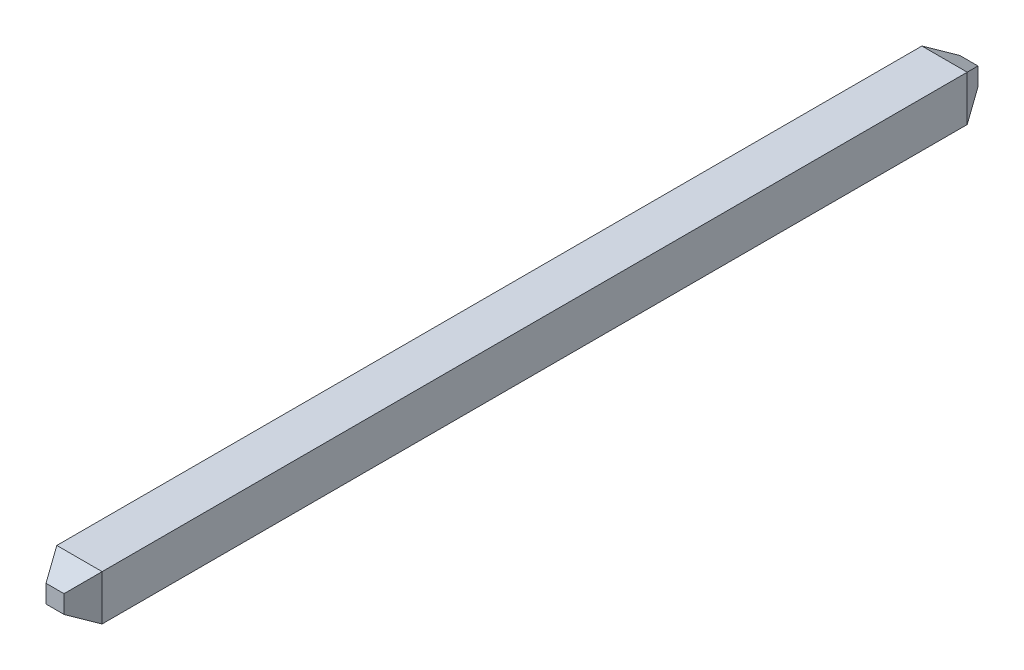
ISO-10303-21;
HEADER;
FILE_DESCRIPTION(('STEP AP214'),'2;1');
FILE_NAME('part.step','',(''),(''),'','','');
FILE_SCHEMA(('AUTOMOTIVE_DESIGN { 1 0 10303 214 1 1 1 1 }'));
ENDSEC;
DATA;
#1=APPLICATION_CONTEXT('core data for automotive mechanical design processes');
#2=APPLICATION_PROTOCOL_DEFINITION('international standard','automotive_design',2000,#1);
#3=PRODUCT_CONTEXT('',#1,'mechanical');
#4=PRODUCT('Part','Part','',(#3));
#5=PRODUCT_RELATED_PRODUCT_CATEGORY('part','',(#4));
#6=PRODUCT_DEFINITION_FORMATION('','',#4);
#7=PRODUCT_DEFINITION_CONTEXT('part definition',#1,'design');
#8=PRODUCT_DEFINITION('design','',#6,#7);
#9=PRODUCT_DEFINITION_SHAPE('','',#8);
#10=(LENGTH_UNIT() NAMED_UNIT(*) SI_UNIT(.MILLI.,.METRE.));
#11=(NAMED_UNIT(*) PLANE_ANGLE_UNIT() SI_UNIT($,.RADIAN.));
#12=(NAMED_UNIT(*) SI_UNIT($,.STERADIAN.) SOLID_ANGLE_UNIT());
#13=UNCERTAINTY_MEASURE_WITH_UNIT(LENGTH_MEASURE(1.E-05),#10,'distance_accuracy_value','');
#14=(GEOMETRIC_REPRESENTATION_CONTEXT(3) GLOBAL_UNCERTAINTY_ASSIGNED_CONTEXT((#13)) GLOBAL_UNIT_ASSIGNED_CONTEXT((#10,
#11,#12)) REPRESENTATION_CONTEXT('',''));
#15=CARTESIAN_POINT('',(0.,0.,0.));
#16=DIRECTION('',(0.,0.,1.));
#17=DIRECTION('',(1.,0.,0.));
#18=AXIS2_PLACEMENT_3D('',#15,#16,#17);
#19=CARTESIAN_POINT('',(10.2801151004192,-1.595,-3.20872569516347));
#20=DIRECTION('',(0.872569516347454,0.,-0.48848995807608));
#21=DIRECTION('',(-0.48848995807608,0.,-0.872569516347454));
#22=AXIS2_PLACEMENT_3D('',#19,#20,#21);
#23=PLANE('',#22);
#24=DIRECTION('',(0.,1.,0.));
#25=VECTOR('',#24,1.);
#26=CARTESIAN_POINT('',(10.4753418566447,-1.595,-2.86000017186176));
#27=LINE('',#26,#25);
#28=CARTESIAN_POINT('',(10.4753418566326,-1.58500002468493,-2.85999984563026));
#29=VERTEX_POINT('',#28);
#30=CARTESIAN_POINT('',(10.4753420172919,-0.954999839641339,-2.85999988490429));
#31=VERTEX_POINT('',#30);
#32=EDGE_CURVE('E145',#29,#31,#27,.T.);
#33=ORIENTED_EDGE('',*,*,#32,.F.);
#34=DIRECTION('',(0.439072617568685,-0.438284036988102,0.784297353956263));
#35=VECTOR('',#34,1.);
#36=CARTESIAN_POINT('',(10.285,-1.395,-3.2));
#37=LINE('',#36,#35);
#38=CARTESIAN_POINT('',(10.285,-1.395,-3.2));
#39=VERTEX_POINT('',#38);
#40=EDGE_CURVE('E142',#39,#29,#37,.T.);
#41=ORIENTED_EDGE('',*,*,#40,.F.);
#42=DIRECTION('',(0.,1.,0.));
#43=VECTOR('',#42,1.);
#44=CARTESIAN_POINT('',(10.285,-1.405,-3.2));
#45=LINE('',#44,#43);
#46=CARTESIAN_POINT('',(10.285,-1.145,-3.2));
#47=VERTEX_POINT('',#46);
#48=EDGE_CURVE('E95',#47,#39,#45,.F.);
#49=ORIENTED_EDGE('',*,*,#48,.F.);
#50=DIRECTION('',(-0.439072617568685,-0.438284036988102,-0.784297353956263));
#51=VECTOR('',#50,1.);
#52=CARTESIAN_POINT('',(10.4753418566447,-0.955000000000001,-2.86000017186176));
#53=LINE('',#52,#51);
#54=EDGE_CURVE('E134',#31,#47,#53,.T.);
#55=ORIENTED_EDGE('',*,*,#54,.F.);
#56=EDGE_LOOP('',(#33,#41,#49,#55));
#57=FACE_BOUND('',#56,.T.);
#58=ADVANCED_FACE('F16',(#57),#23,.T.);
#59=CARTESIAN_POINT('',(10.2803670281429,-1.595,9.50441734607014));
#60=DIRECTION('',(0.873317045523296,0.,0.487152273933378));
#61=DIRECTION('',(0.487152273933378,0.,-0.873317045523296));
#62=AXIS2_PLACEMENT_3D('',#59,#60,#61);
#63=PLANE('',#62);
#64=DIRECTION('',(-0.437799852400756,0.438586917260879,0.784839349959898));
#65=VECTOR('',#64,1.);
#66=CARTESIAN_POINT('',(10.4748978995516,-1.58500031317149,9.15568378706481));
#67=LINE('',#66,#65);
#68=CARTESIAN_POINT('',(10.4748976545499,-1.58500010892316,9.155683688451));
#69=VERTEX_POINT('',#68);
#70=CARTESIAN_POINT('',(10.2852385508823,-1.395,9.4956841756149));
#71=VERTEX_POINT('',#70);
#72=EDGE_CURVE('E151',#69,#71,#67,.T.);
#73=ORIENTED_EDGE('',*,*,#72,.F.);
#74=DIRECTION('',(0.,1.,0.));
#75=VECTOR('',#74,1.);
#76=CARTESIAN_POINT('',(10.4748985390065,-1.595,9.15568372243695));
#77=LINE('',#76,#75);
#78=CARTESIAN_POINT('',(10.4748976528046,-0.954999822967403,9.15568371270384));
#79=VERTEX_POINT('',#78);
#80=EDGE_CURVE('E106',#79,#69,#77,.F.);
#81=ORIENTED_EDGE('',*,*,#80,.F.);
#82=DIRECTION('',(0.437799852400942,0.438586917260834,-0.784839349959819));
#83=VECTOR('',#82,1.);
#84=CARTESIAN_POINT('',(10.2852385508823,-1.145,9.49568417561491));
#85=LINE('',#84,#83);
#86=CARTESIAN_POINT('',(10.2852385508823,-1.145,9.4956841756149));
#87=VERTEX_POINT('',#86);
#88=EDGE_CURVE('E101',#87,#79,#85,.T.);
#89=ORIENTED_EDGE('',*,*,#88,.F.);
#90=DIRECTION('',(0.,1.,0.));
#91=VECTOR('',#90,1.);
#92=CARTESIAN_POINT('',(10.2852385508823,-1.135,9.49568417561491));
#93=LINE('',#92,#91);
#94=EDGE_CURVE('E19',#71,#87,#93,.T.);
#95=ORIENTED_EDGE('',*,*,#94,.F.);
#96=EDGE_LOOP('',(#73,#81,#89,#95));
#97=FACE_BOUND('',#96,.T.);
#98=ADVANCED_FACE('F103',(#97),#63,.T.);
#99=CARTESIAN_POINT('',(10.0252385508823,-1.135,9.49568417561491));
#100=DIRECTION('',(0.,0.,1.));
#101=DIRECTION('',(1.,0.,0.));
#102=AXIS2_PLACEMENT_3D('',#99,#100,#101);
#103=PLANE('',#102);
#104=DIRECTION('',(1.,0.,0.));
#105=VECTOR('',#104,1.);
#106=CARTESIAN_POINT('',(9.8348966942376,-1.145,9.49568417561491));
#107=LINE('',#106,#105);
#108=CARTESIAN_POINT('',(10.0352385508823,-1.145,9.49568417561492));
#109=VERTEX_POINT('',#108);
#110=EDGE_CURVE('E111',#109,#87,#107,.T.);
#111=ORIENTED_EDGE('',*,*,#110,.F.);
#112=DIRECTION('',(0.,1.,0.));
#113=VECTOR('',#112,1.);
#114=CARTESIAN_POINT('',(10.0352385508823,-1.595,9.49568417561494));
#115=LINE('',#114,#113);
#116=CARTESIAN_POINT('',(10.0352385508823,-1.395,9.49568417561492));
#117=VERTEX_POINT('',#116);
#118=EDGE_CURVE('E161',#117,#109,#115,.T.);
#119=ORIENTED_EDGE('',*,*,#118,.F.);
#120=DIRECTION('',(1.,0.,0.));
#121=VECTOR('',#120,1.);
#122=CARTESIAN_POINT('',(9.8348966942376,-1.395,9.49568417561491));
#123=LINE('',#122,#121);
#124=EDGE_CURVE('E116',#71,#117,#123,.F.);
#125=ORIENTED_EDGE('',*,*,#124,.F.);
#126=ORIENTED_EDGE('',*,*,#94,.T.);
#127=EDGE_LOOP('',(#111,#119,#125,#126));
#128=FACE_BOUND('',#127,.T.);
#129=ADVANCED_FACE('F113',(#128),#103,.T.);
#130=CARTESIAN_POINT('',(9.8348966942376,-1.14987821545568,9.50441360938624));
#131=DIRECTION('',(0.,0.872943377132664,0.487821545567864));
#132=DIRECTION('',(0.,-0.487821545567864,0.872943377132664));
#133=AXIS2_PLACEMENT_3D('',#130,#131,#132);
#134=PLANE('',#133);
#135=DIRECTION('',(-0.439072459537936,0.438284700441645,-0.784297071672516));
#136=VECTOR('',#135,1.);
#137=CARTESIAN_POINT('',(10.0352385508823,-1.145,9.49568417561494));
#138=LINE('',#137,#136);
#139=CARTESIAN_POINT('',(9.84489750370277,-0.954999917527418,9.15568447138296));
#140=VERTEX_POINT('',#139);
#141=EDGE_CURVE('E121',#109,#140,#138,.T.);
#142=ORIENTED_EDGE('',*,*,#141,.F.);
#143=ORIENTED_EDGE('',*,*,#110,.T.);
#144=ORIENTED_EDGE('',*,*,#88,.T.);
#145=DIRECTION('',(1.,0.,0.));
#146=VECTOR('',#145,1.);
#147=CARTESIAN_POINT('',(10.1600665893728,-0.955,9.15568497320465));
#148=LINE('',#147,#146);
#149=EDGE_CURVE('E164',#140,#79,#148,.T.);
#150=ORIENTED_EDGE('',*,*,#149,.F.);
#151=EDGE_LOOP('',(#142,#143,#144,#150));
#152=FACE_BOUND('',#151,.T.);
#153=ADVANCED_FACE('F119',(#152),#134,.T.);
#154=CARTESIAN_POINT('',(10.025,-1.405,-3.2));
#155=DIRECTION('',(0.,0.,-1.));
#156=DIRECTION('',(-1.,0.,0.));
#157=AXIS2_PLACEMENT_3D('',#154,#155,#156);
#158=PLANE('',#157);
#159=ORIENTED_EDGE('',*,*,#48,.T.);
#160=DIRECTION('',(1.,0.,0.));
#161=VECTOR('',#160,1.);
#162=CARTESIAN_POINT('',(9.83534185664468,-1.395,-3.2));
#163=LINE('',#162,#161);
#164=CARTESIAN_POINT('',(10.035,-1.395,-3.2));
#165=VERTEX_POINT('',#164);
#166=EDGE_CURVE('E138',#165,#39,#163,.T.);
#167=ORIENTED_EDGE('',*,*,#166,.F.);
#168=DIRECTION('',(0.,1.,0.));
#169=VECTOR('',#168,1.);
#170=CARTESIAN_POINT('',(10.035,-1.595,-3.20000000000001));
#171=LINE('',#170,#169);
#172=CARTESIAN_POINT('',(10.035,-1.145,-3.2));
#173=VERTEX_POINT('',#172);
#174=EDGE_CURVE('E176',#173,#165,#171,.F.);
#175=ORIENTED_EDGE('',*,*,#174,.F.);
#176=DIRECTION('',(1.,0.,0.));
#177=VECTOR('',#176,1.);
#178=CARTESIAN_POINT('',(9.83534185664468,-1.145,-3.2));
#179=LINE('',#178,#177);
#180=EDGE_CURVE('E128',#47,#173,#179,.F.);
#181=ORIENTED_EDGE('',*,*,#180,.F.);
#182=EDGE_LOOP('',(#159,#167,#175,#181));
#183=FACE_BOUND('',#182,.T.);
#184=ADVANCED_FACE('F229',(#183),#158,.T.);
#185=CARTESIAN_POINT('',(9.83534185664468,-0.950121784544321,-2.85127073809043));
#186=DIRECTION('',(0.,0.872943377132663,-0.487821545567865));
#187=DIRECTION('',(0.,0.487821545567865,0.872943377132663));
#188=AXIS2_PLACEMENT_3D('',#185,#186,#187);
#189=PLANE('',#188);
#190=DIRECTION('',(1.,0.,0.));
#191=VECTOR('',#190,1.);
#192=CARTESIAN_POINT('',(10.1600665893728,-0.955,-2.86000017186176));
#193=LINE('',#192,#191);
#194=CARTESIAN_POINT('',(9.84534144768618,-0.954999293190896,-2.8599984305592));
#195=VERTEX_POINT('',#194);
#196=EDGE_CURVE('E172',#31,#195,#193,.F.);
#197=ORIENTED_EDGE('',*,*,#196,.F.);
#198=ORIENTED_EDGE('',*,*,#54,.T.);
#199=ORIENTED_EDGE('',*,*,#180,.T.);
#200=DIRECTION('',(0.437798396819591,-0.438586429089659,-0.784840434713055));
#201=VECTOR('',#200,1.);
#202=CARTESIAN_POINT('',(9.84534066407529,-0.954999279369218,-2.85999803394472));
#203=LINE('',#202,#201);
#204=EDGE_CURVE('E183',#195,#173,#203,.T.);
#205=ORIENTED_EDGE('',*,*,#204,.F.);
#206=EDGE_LOOP('',(#197,#198,#199,#205));
#207=FACE_BOUND('',#206,.T.);
#208=ADVANCED_FACE('F227',(#207),#189,.T.);
#209=CARTESIAN_POINT('',(9.83534185664468,-1.39012178454432,-3.20872943377133));
#210=DIRECTION('',(0.,-0.872943377132663,-0.487821545567865));
#211=DIRECTION('',(0.,0.487821545567865,-0.872943377132663));
#212=AXIS2_PLACEMENT_3D('',#209,#210,#211);
#213=PLANE('',#212);
#214=ORIENTED_EDGE('',*,*,#166,.T.);
#215=ORIENTED_EDGE('',*,*,#40,.T.);
#216=DIRECTION('',(1.,0.,0.));
#217=VECTOR('',#216,1.);
#218=CARTESIAN_POINT('',(9.83494834685547,-1.585,-2.85999756200983));
#219=LINE('',#218,#217);
#220=CARTESIAN_POINT('',(9.84534198218487,-1.58500027023654,-2.85999898491792));
#221=VERTEX_POINT('',#220);
#222=EDGE_CURVE('E39',#221,#29,#219,.T.);
#223=ORIENTED_EDGE('',*,*,#222,.F.);
#224=DIRECTION('',(-0.437798396819591,-0.438586429089663,0.784840434713053));
#225=VECTOR('',#224,1.);
#226=CARTESIAN_POINT('',(10.035,-1.395,-3.20000000000001));
#227=LINE('',#226,#225);
#228=EDGE_CURVE('E180',#165,#221,#227,.T.);
#229=ORIENTED_EDGE('',*,*,#228,.F.);
#230=EDGE_LOOP('',(#214,#215,#223,#229));
#231=FACE_BOUND('',#230,.T.);
#232=ADVANCED_FACE('F230',(#231),#213,.T.);
#233=CARTESIAN_POINT('',(10.4753463082688,-1.595,-2.98065701705514));
#234=DIRECTION('',(0.999999999319383,0.,3.68949151672057E-05));
#235=DIRECTION('',(3.68949151672057E-05,0.,-0.999999999319383));
#236=AXIS2_PLACEMENT_3D('',#233,#234,#235);
#237=PLANE('',#236);
#238=DIRECTION('',(3.69481335064168E-05,0.,-0.999999999317418));
#239=VECTOR('',#238,1.);
#240=CARTESIAN_POINT('',(10.4748978995517,-0.955,9.15568372241336));
#241=LINE('',#240,#239);
#242=EDGE_CURVE('E168',#79,#31,#241,.T.);
#243=ORIENTED_EDGE('',*,*,#242,.F.);
#244=ORIENTED_EDGE('',*,*,#80,.T.);
#245=DIRECTION('',(-3.69481335147904E-05,0.,0.999999999317418));
#246=VECTOR('',#245,1.);
#247=CARTESIAN_POINT('',(10.4753418566447,-1.585,-2.86000017186176));
#248=LINE('',#247,#246);
#249=EDGE_CURVE('E189',#29,#69,#248,.T.);
#250=ORIENTED_EDGE('',*,*,#249,.F.);
#251=ORIENTED_EDGE('',*,*,#32,.T.);
#252=EDGE_LOOP('',(#243,#244,#250,#251));
#253=FACE_BOUND('',#252,.T.);
#254=ADVANCED_FACE('F232',(#253),#237,.T.);
#255=CARTESIAN_POINT('',(9.8348966942376,-1.58987821545568,9.14695491370534));
#256=DIRECTION('',(0.,-0.872943377132664,0.487821545567864));
#257=DIRECTION('',(0.,-0.487821545567864,-0.872943377132664));
#258=AXIS2_PLACEMENT_3D('',#255,#256,#257);
#259=PLANE('',#258);
#260=ORIENTED_EDGE('',*,*,#124,.T.);
#261=DIRECTION('',(0.439072459537937,0.438284700441644,0.784297071672517));
#262=VECTOR('',#261,1.);
#263=CARTESIAN_POINT('',(9.84489724886551,-1.5849998023649,9.15568533818577));
#264=LINE('',#263,#262);
#265=CARTESIAN_POINT('',(9.84489781760236,-1.58499988392429,9.15568487573229));
#266=VERTEX_POINT('',#265);
#267=EDGE_CURVE('E157',#266,#117,#264,.T.);
#268=ORIENTED_EDGE('',*,*,#267,.F.);
#269=DIRECTION('',(1.,0.,0.));
#270=VECTOR('',#269,1.);
#271=CARTESIAN_POINT('',(9.83494834685547,-1.585,9.15568372241336));
#272=LINE('',#271,#270);
#273=EDGE_CURVE('E193',#69,#266,#272,.F.);
#274=ORIENTED_EDGE('',*,*,#273,.F.);
#275=ORIENTED_EDGE('',*,*,#72,.T.);
#276=EDGE_LOOP('',(#260,#268,#274,#275));
#277=FACE_BOUND('',#276,.T.);
#278=ADVANCED_FACE('F219',(#277),#259,.T.);
#279=CARTESIAN_POINT('',(10.040123450463,-1.595,9.50440987077839));
#280=DIRECTION('',(-0.872569516347452,0.,0.488489958076083));
#281=DIRECTION('',(0.488489958076083,0.,0.872569516347452));
#282=AXIS2_PLACEMENT_3D('',#279,#280,#281);
#283=PLANE('',#282);
#284=ORIENTED_EDGE('',*,*,#267,.T.);
#285=ORIENTED_EDGE('',*,*,#118,.T.);
#286=ORIENTED_EDGE('',*,*,#141,.T.);
#287=DIRECTION('',(0.,1.,0.));
#288=VECTOR('',#287,1.);
#289=CARTESIAN_POINT('',(9.84489853896027,-1.595,9.15568497322819));
#290=LINE('',#289,#288);
#291=EDGE_CURVE('E197',#266,#140,#290,.T.);
#292=ORIENTED_EDGE('',*,*,#291,.F.);
#293=EDGE_LOOP('',(#284,#285,#286,#292));
#294=FACE_BOUND('',#293,.T.);
#295=ADVANCED_FACE('F222',(#294),#283,.T.);
#296=CARTESIAN_POINT('',(10.1600665893728,-0.955,9.32634470275115));
#297=DIRECTION('',(0.,1.,0.));
#298=DIRECTION('',(0.,0.,1.));
#299=AXIS2_PLACEMENT_3D('',#296,#297,#298);
#300=PLANE('',#299);
#301=ORIENTED_EDGE('',*,*,#196,.T.);
#302=DIRECTION('',(-3.68949151673762E-05,0.,0.999999999319383));
#303=VECTOR('',#302,1.);
#304=CARTESIAN_POINT('',(9.84489224235438,-0.955000197635099,9.32634821671993));
#305=LINE('',#304,#303);
#306=EDGE_CURVE('E201',#140,#195,#305,.F.);
#307=ORIENTED_EDGE('',*,*,#306,.F.);
#308=ORIENTED_EDGE('',*,*,#149,.T.);
#309=ORIENTED_EDGE('',*,*,#242,.T.);
#310=EDGE_LOOP('',(#301,#307,#308,#309));
#311=FACE_BOUND('',#310,.T.);
#312=ADVANCED_FACE('F224',(#311),#300,.T.);
#313=CARTESIAN_POINT('',(10.0398715227393,-1.595,-3.20873317045523));
#314=DIRECTION('',(-0.873317045523299,0.,-0.487152273933373));
#315=DIRECTION('',(-0.487152273933373,0.,0.873317045523299));
#316=AXIS2_PLACEMENT_3D('',#313,#314,#315);
#317=PLANE('',#316);
#318=DIRECTION('',(0.,1.,0.));
#319=VECTOR('',#318,1.);
#320=CARTESIAN_POINT('',(9.84534185654839,-1.595,-2.85999756199704));
#321=LINE('',#320,#319);
#322=EDGE_CURVE('E26',#195,#221,#321,.F.);
#323=ORIENTED_EDGE('',*,*,#322,.F.);
#324=ORIENTED_EDGE('',*,*,#204,.T.);
#325=ORIENTED_EDGE('',*,*,#174,.T.);
#326=ORIENTED_EDGE('',*,*,#228,.T.);
#327=EDGE_LOOP('',(#323,#324,#325,#326));
#328=FACE_BOUND('',#327,.T.);
#329=ADVANCED_FACE('F213',(#328),#317,.T.);
#330=CARTESIAN_POINT('',(9.83494834685547,-1.585,3.17284922525592));
#331=DIRECTION('',(0.,-1.,0.));
#332=DIRECTION('',(0.,0.,-1.));
#333=AXIS2_PLACEMENT_3D('',#330,#331,#332);
#334=PLANE('',#333);
#335=ORIENTED_EDGE('',*,*,#249,.T.);
#336=ORIENTED_EDGE('',*,*,#273,.T.);
#337=DIRECTION('',(-3.68949151673762E-05,0.,0.999999999319383));
#338=VECTOR('',#337,1.);
#339=CARTESIAN_POINT('',(9.84489224235438,-1.58500072063078,9.32634821671993));
#340=LINE('',#339,#338);
#341=EDGE_CURVE('E11',#221,#266,#340,.T.);
#342=ORIENTED_EDGE('',*,*,#341,.F.);
#343=ORIENTED_EDGE('',*,*,#222,.T.);
#344=EDGE_LOOP('',(#335,#336,#342,#343));
#345=FACE_BOUND('',#344,.T.);
#346=ADVANCED_FACE('F215',(#345),#334,.T.);
#347=CARTESIAN_POINT('',(9.84489224235438,-1.595,9.32634821671993));
#348=DIRECTION('',(-0.999999999319383,0.,-3.68949151673762E-05));
#349=DIRECTION('',(-3.68949151673762E-05,0.,0.999999999319383));
#350=AXIS2_PLACEMENT_3D('',#347,#348,#349);
#351=PLANE('',#350);
#352=ORIENTED_EDGE('',*,*,#322,.T.);
#353=ORIENTED_EDGE('',*,*,#341,.T.);
#354=ORIENTED_EDGE('',*,*,#291,.T.);
#355=ORIENTED_EDGE('',*,*,#306,.T.);
#356=EDGE_LOOP('',(#352,#353,#354,#355));
#357=FACE_BOUND('',#356,.T.);
#358=ADVANCED_FACE('F209',(#357),#351,.T.);
#359=CLOSED_SHELL('',(#58,#98,#129,#153,#184,#208,#232,#254,#278,#295,#312,#329,#346,#358));
#360=MANIFOLD_SOLID_BREP('B1',#359);
#361=ADVANCED_BREP_SHAPE_REPRESENTATION('',(#18,#360),#14);
#362=SHAPE_DEFINITION_REPRESENTATION(#9,#361);
ENDSEC;
END-ISO-10303-21;
